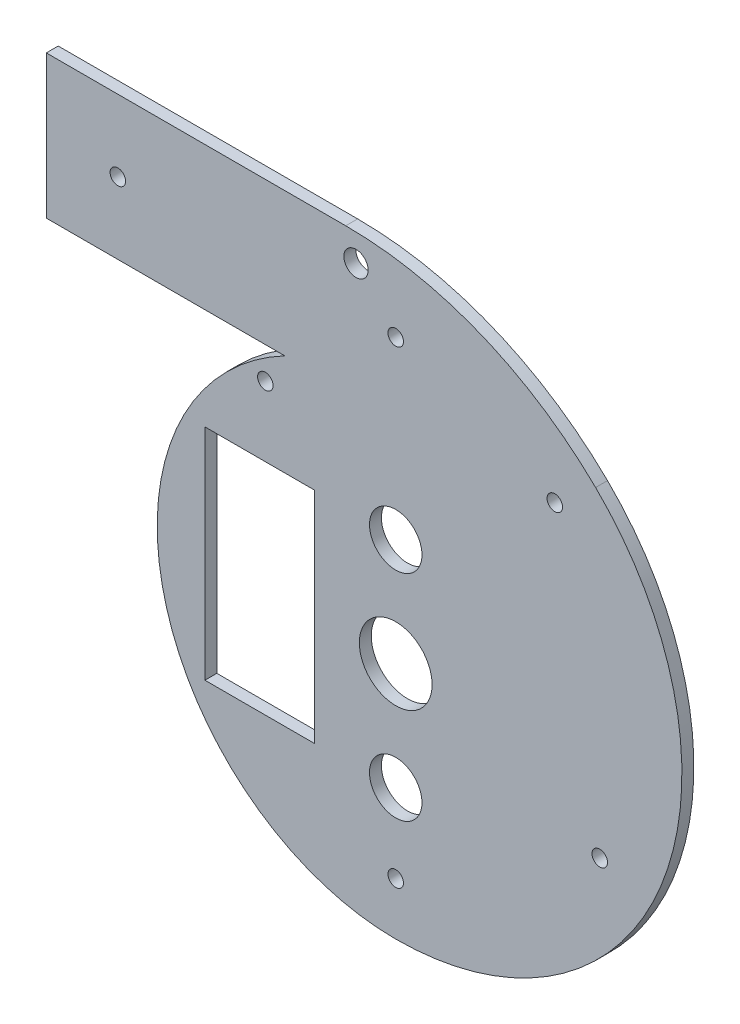
ISO-10303-21;
HEADER;
FILE_DESCRIPTION(('STEP AP214'),'2;1');
FILE_NAME('part.step','',(''),(''),'','','');
FILE_SCHEMA(('AUTOMOTIVE_DESIGN { 1 0 10303 214 1 1 1 1 }'));
ENDSEC;
DATA;
#1=APPLICATION_CONTEXT('core data for automotive mechanical design processes');
#2=APPLICATION_PROTOCOL_DEFINITION('international standard','automotive_design',2000,#1);
#3=PRODUCT_CONTEXT('',#1,'mechanical');
#4=PRODUCT('Part','Part','',(#3));
#5=PRODUCT_RELATED_PRODUCT_CATEGORY('part','',(#4));
#6=PRODUCT_DEFINITION_FORMATION('','',#4);
#7=PRODUCT_DEFINITION_CONTEXT('part definition',#1,'design');
#8=PRODUCT_DEFINITION('design','',#6,#7);
#9=PRODUCT_DEFINITION_SHAPE('','',#8);
#10=(LENGTH_UNIT() NAMED_UNIT(*) SI_UNIT(.MILLI.,.METRE.));
#11=(NAMED_UNIT(*) PLANE_ANGLE_UNIT() SI_UNIT($,.RADIAN.));
#12=(NAMED_UNIT(*) SI_UNIT($,.STERADIAN.) SOLID_ANGLE_UNIT());
#13=UNCERTAINTY_MEASURE_WITH_UNIT(LENGTH_MEASURE(1.E-05),#10,'distance_accuracy_value','');
#14=(GEOMETRIC_REPRESENTATION_CONTEXT(3) GLOBAL_UNCERTAINTY_ASSIGNED_CONTEXT((#13)) GLOBAL_UNIT_ASSIGNED_CONTEXT((#10,
#11,#12)) REPRESENTATION_CONTEXT('',''));
#15=CARTESIAN_POINT('',(0.,0.,0.));
#16=DIRECTION('',(0.,0.,1.));
#17=DIRECTION('',(1.,0.,0.));
#18=AXIS2_PLACEMENT_3D('',#15,#16,#17);
#19=CARTESIAN_POINT('',(-46.5031531468045,88.5294117647059,-5.));
#20=DIRECTION('',(0.,-1.,0.));
#21=DIRECTION('',(1.,0.,0.));
#22=AXIS2_PLACEMENT_3D('',#19,#20,#21);
#23=PLANE('',#22);
#24=DIRECTION('',(1.,0.,0.));
#25=VECTOR('',#24,1.);
#26=CARTESIAN_POINT('',(-46.5031531468045,88.5294117647059,0.));
#27=LINE('',#26,#25);
#28=CARTESIAN_POINT('',(-146.503153146805,88.5294117647059,0.));
#29=VERTEX_POINT('',#28);
#30=CARTESIAN_POINT('',(-46.5031531468045,88.5294117647059,0.));
#31=VERTEX_POINT('',#30);
#32=EDGE_CURVE('E213',#29,#31,#27,.T.);
#33=ORIENTED_EDGE('',*,*,#32,.F.);
#34=DIRECTION('',(0.,0.,1.));
#35=VECTOR('',#34,1.);
#36=CARTESIAN_POINT('',(-146.503153146805,88.5294117647059,-5.));
#37=LINE('',#36,#35);
#38=CARTESIAN_POINT('',(-146.503153146805,88.5294117647059,-5.));
#39=VERTEX_POINT('',#38);
#40=EDGE_CURVE('E45',#39,#29,#37,.T.);
#41=ORIENTED_EDGE('',*,*,#40,.F.);
#42=DIRECTION('',(1.,0.,0.));
#43=VECTOR('',#42,1.);
#44=CARTESIAN_POINT('',(-46.5031531468045,88.5294117647059,-5.));
#45=LINE('',#44,#43);
#46=CARTESIAN_POINT('',(-46.5031531468045,88.5294117647059,-5.));
#47=VERTEX_POINT('',#46);
#48=EDGE_CURVE('E225',#39,#47,#45,.T.);
#49=ORIENTED_EDGE('',*,*,#48,.T.);
#50=DIRECTION('',(0.,0.,1.));
#51=VECTOR('',#50,1.);
#52=CARTESIAN_POINT('',(-46.5031531468045,88.5294117647059,-5.));
#53=LINE('',#52,#51);
#54=EDGE_CURVE('E11',#47,#31,#53,.T.);
#55=ORIENTED_EDGE('',*,*,#54,.T.);
#56=EDGE_LOOP('',(#33,#41,#49,#55));
#57=FACE_BOUND('',#56,.T.);
#58=ADVANCED_FACE('F36',(#57),#23,.T.);
#59=CARTESIAN_POINT('',(-146.503153146805,148.529411764706,-5.));
#60=DIRECTION('',(-1.,0.,0.));
#61=DIRECTION('',(0.,0.,1.));
#62=AXIS2_PLACEMENT_3D('',#59,#60,#61);
#63=PLANE('',#62);
#64=DIRECTION('',(0.,-1.,0.));
#65=VECTOR('',#64,1.);
#66=CARTESIAN_POINT('',(-146.503153146805,148.529411764706,0.));
#67=LINE('',#66,#65);
#68=CARTESIAN_POINT('',(-146.503153146805,148.529411764706,0.));
#69=VERTEX_POINT('',#68);
#70=EDGE_CURVE('E239',#69,#29,#67,.T.);
#71=ORIENTED_EDGE('',*,*,#70,.F.);
#72=DIRECTION('',(0.,0.,1.));
#73=VECTOR('',#72,1.);
#74=CARTESIAN_POINT('',(-146.503153146805,148.529411764706,-5.));
#75=LINE('',#74,#73);
#76=CARTESIAN_POINT('',(-146.503153146805,148.529411764706,-5.));
#77=VERTEX_POINT('',#76);
#78=EDGE_CURVE('E245',#77,#69,#75,.T.);
#79=ORIENTED_EDGE('',*,*,#78,.F.);
#80=DIRECTION('',(0.,-1.,0.));
#81=VECTOR('',#80,1.);
#82=CARTESIAN_POINT('',(-146.503153146805,148.529411764706,-5.));
#83=LINE('',#82,#81);
#84=EDGE_CURVE('E222',#77,#39,#83,.T.);
#85=ORIENTED_EDGE('',*,*,#84,.T.);
#86=ORIENTED_EDGE('',*,*,#40,.T.);
#87=EDGE_LOOP('',(#71,#79,#85,#86));
#88=FACE_BOUND('',#87,.T.);
#89=ADVANCED_FACE('F273',(#88),#63,.T.);
#90=CARTESIAN_POINT('',(-20.9526571305515,148.529411764706,-5.));
#91=DIRECTION('',(0.,1.,0.));
#92=DIRECTION('',(0.,0.,1.));
#93=AXIS2_PLACEMENT_3D('',#90,#91,#92);
#94=PLANE('',#93);
#95=DIRECTION('',(-1.,0.,0.));
#96=VECTOR('',#95,1.);
#97=CARTESIAN_POINT('',(-20.9526571305515,148.529411764706,0.));
#98=LINE('',#97,#96);
#99=CARTESIAN_POINT('',(-20.9526571305515,148.529411764706,0.));
#100=VERTEX_POINT('',#99);
#101=EDGE_CURVE('E236',#100,#69,#98,.T.);
#102=ORIENTED_EDGE('',*,*,#101,.F.);
#103=DIRECTION('',(0.,0.,1.));
#104=VECTOR('',#103,1.);
#105=CARTESIAN_POINT('',(-20.9526571305515,148.529411764706,-5.));
#106=LINE('',#105,#104);
#107=CARTESIAN_POINT('',(-20.9526571305515,148.529411764706,-5.));
#108=VERTEX_POINT('',#107);
#109=EDGE_CURVE('E247',#108,#100,#106,.T.);
#110=ORIENTED_EDGE('',*,*,#109,.F.);
#111=DIRECTION('',(-1.,0.,0.));
#112=VECTOR('',#111,1.);
#113=CARTESIAN_POINT('',(-20.9526571305515,148.529411764706,-5.));
#114=LINE('',#113,#112);
#115=EDGE_CURVE('E219',#108,#77,#114,.T.);
#116=ORIENTED_EDGE('',*,*,#115,.T.);
#117=ORIENTED_EDGE('',*,*,#78,.T.);
#118=EDGE_LOOP('',(#102,#110,#116,#117));
#119=FACE_BOUND('',#118,.T.);
#120=ADVANCED_FACE('F271',(#119),#94,.T.);
#121=CARTESIAN_POINT('',(-20.9526571305515,-1.47058823529413,-5.));
#122=DIRECTION('',(0.,0.,1.));
#123=DIRECTION('',(1.,0.,0.));
#124=AXIS2_PLACEMENT_3D('',#121,#122,#123);
#125=CYLINDRICAL_SURFACE('',#124,150.);
#126=CARTESIAN_POINT('',(-20.9526571305515,-1.47058823529413,0.));
#127=DIRECTION('',(0.,0.,1.));
#128=DIRECTION('',(1.,0.,0.));
#129=AXIS2_PLACEMENT_3D('',#126,#127,#128);
#130=CIRCLE('',#129,150.);
#131=CARTESIAN_POINT('',(83.810628522206,105.882352941176,0.));
#132=VERTEX_POINT('',#131);
#133=EDGE_CURVE('E233',#132,#100,#130,.T.);
#134=ORIENTED_EDGE('',*,*,#133,.F.);
#135=DIRECTION('',(0.,0.,1.));
#136=VECTOR('',#135,1.);
#137=CARTESIAN_POINT('',(83.810628522206,105.882352941176,-5.));
#138=LINE('',#137,#136);
#139=CARTESIAN_POINT('',(83.810628522206,105.882352941176,-5.));
#140=VERTEX_POINT('',#139);
#141=EDGE_CURVE('E248',#140,#132,#138,.T.);
#142=ORIENTED_EDGE('',*,*,#141,.F.);
#143=CARTESIAN_POINT('',(-20.9526571305515,-1.47058823529413,-5.));
#144=DIRECTION('',(0.,0.,1.));
#145=DIRECTION('',(1.,0.,0.));
#146=AXIS2_PLACEMENT_3D('',#143,#144,#145);
#147=CIRCLE('',#146,150.);
#148=EDGE_CURVE('E216',#140,#108,#147,.T.);
#149=ORIENTED_EDGE('',*,*,#148,.T.);
#150=ORIENTED_EDGE('',*,*,#109,.T.);
#151=EDGE_LOOP('',(#134,#142,#149,#150));
#152=FACE_BOUND('',#151,.T.);
#153=ADVANCED_FACE('F268',(#152),#125,.T.);
#154=CARTESIAN_POINT('',(0.,20.,-5.));
#155=DIRECTION('',(0.,0.,1.));
#156=DIRECTION('',(1.,0.,0.));
#157=AXIS2_PLACEMENT_3D('',#154,#155,#156);
#158=CYLINDRICAL_SURFACE('',#157,120.);
#159=CARTESIAN_POINT('',(0.,20.,0.));
#160=DIRECTION('',(0.,0.,1.));
#161=DIRECTION('',(1.,0.,0.));
#162=AXIS2_PLACEMENT_3D('',#159,#160,#161);
#163=CIRCLE('',#162,120.);
#164=CARTESIAN_POINT('',(0.,-100.,0.));
#165=VERTEX_POINT('',#164);
#166=EDGE_CURVE('E230',#165,#132,#163,.T.);
#167=ORIENTED_EDGE('',*,*,#166,.F.);
#168=DIRECTION('',(0.,0.,1.));
#169=VECTOR('',#168,1.);
#170=CARTESIAN_POINT('',(0.,-100.,-5.));
#171=LINE('',#170,#169);
#172=CARTESIAN_POINT('',(0.,-100.,-5.));
#173=VERTEX_POINT('',#172);
#174=EDGE_CURVE('E40',#173,#165,#171,.T.);
#175=ORIENTED_EDGE('',*,*,#174,.F.);
#176=CARTESIAN_POINT('',(0.,20.,-5.));
#177=DIRECTION('',(0.,0.,1.));
#178=DIRECTION('',(1.,0.,0.));
#179=AXIS2_PLACEMENT_3D('',#176,#177,#178);
#180=CIRCLE('',#179,120.);
#181=EDGE_CURVE('E212',#173,#140,#180,.T.);
#182=ORIENTED_EDGE('',*,*,#181,.T.);
#183=ORIENTED_EDGE('',*,*,#141,.T.);
#184=EDGE_LOOP('',(#167,#175,#182,#183));
#185=FACE_BOUND('',#184,.T.);
#186=ADVANCED_FACE('F256',(#185),#158,.T.);
#187=CARTESIAN_POINT('',(0.,0.,-5.));
#188=DIRECTION('',(0.,0.,1.));
#189=DIRECTION('',(1.,0.,0.));
#190=AXIS2_PLACEMENT_3D('',#187,#188,#189);
#191=CYLINDRICAL_SURFACE('',#190,100.);
#192=CARTESIAN_POINT('',(0.,0.,0.));
#193=DIRECTION('',(0.,0.,1.));
#194=DIRECTION('',(1.,0.,0.));
#195=AXIS2_PLACEMENT_3D('',#192,#193,#194);
#196=CIRCLE('',#195,100.);
#197=EDGE_CURVE('E207',#31,#165,#196,.T.);
#198=ORIENTED_EDGE('',*,*,#197,.F.);
#199=ORIENTED_EDGE('',*,*,#54,.F.);
#200=CARTESIAN_POINT('',(0.,0.,-5.));
#201=DIRECTION('',(0.,0.,1.));
#202=DIRECTION('',(-1.,0.,0.));
#203=AXIS2_PLACEMENT_3D('',#200,#201,#202);
#204=CIRCLE('',#203,100.);
#205=EDGE_CURVE('E210',#47,#173,#204,.T.);
#206=ORIENTED_EDGE('',*,*,#205,.T.);
#207=ORIENTED_EDGE('',*,*,#174,.T.);
#208=EDGE_LOOP('',(#198,#199,#206,#207));
#209=FACE_BOUND('',#208,.T.);
#210=ADVANCED_FACE('F38',(#209),#191,.T.);
#211=CARTESIAN_POINT('',(0.,0.,-5.));
#212=DIRECTION('',(0.,0.,-1.));
#213=DIRECTION('',(-1.,0.,0.));
#214=AXIS2_PLACEMENT_3D('',#211,#212,#213);
#215=PLANE('',#214);
#216=DIRECTION('',(0.,-1.,0.));
#217=VECTOR('',#216,1.);
#218=CARTESIAN_POINT('',(-80.,46.,-5.));
#219=LINE('',#218,#217);
#220=CARTESIAN_POINT('',(-80.,46.,-5.));
#221=VERTEX_POINT('',#220);
#222=CARTESIAN_POINT('',(-80.,-46.,-5.));
#223=VERTEX_POINT('',#222);
#224=EDGE_CURVE('E125',#221,#223,#219,.T.);
#225=ORIENTED_EDGE('',*,*,#224,.T.);
#226=DIRECTION('',(1.,0.,0.));
#227=VECTOR('',#226,1.);
#228=CARTESIAN_POINT('',(-80.,-46.,-5.));
#229=LINE('',#228,#227);
#230=CARTESIAN_POINT('',(-34.,-46.,-5.));
#231=VERTEX_POINT('',#230);
#232=EDGE_CURVE('E114',#223,#231,#229,.T.);
#233=ORIENTED_EDGE('',*,*,#232,.T.);
#234=DIRECTION('',(0.,1.,0.));
#235=VECTOR('',#234,1.);
#236=CARTESIAN_POINT('',(-34.,46.,-5.));
#237=LINE('',#236,#235);
#238=CARTESIAN_POINT('',(-34.,46.,-5.));
#239=VERTEX_POINT('',#238);
#240=EDGE_CURVE('E136',#231,#239,#237,.T.);
#241=ORIENTED_EDGE('',*,*,#240,.T.);
#242=DIRECTION('',(-1.,0.,0.));
#243=VECTOR('',#242,1.);
#244=CARTESIAN_POINT('',(-80.,46.,-5.));
#245=LINE('',#244,#243);
#246=EDGE_CURVE('E132',#239,#221,#245,.T.);
#247=ORIENTED_EDGE('',*,*,#246,.T.);
#248=EDGE_LOOP('',(#225,#233,#241,#247));
#249=FACE_BOUND('',#248,.T.);
#250=CARTESIAN_POINT('',(-116.503153146805,118.529411764706,-5.));
#251=DIRECTION('',(0.,0.,-1.));
#252=DIRECTION('',(-1.,0.,0.));
#253=AXIS2_PLACEMENT_3D('',#250,#251,#252);
#254=CIRCLE('',#253,3.25000000000001);
#255=CARTESIAN_POINT('',(-119.753153146805,118.529411764706,-5.));
#256=VERTEX_POINT('',#255);
#257=EDGE_CURVE('E182',#256,#256,#254,.T.);
#258=ORIENTED_EDGE('',*,*,#257,.F.);
#259=EDGE_LOOP('',(#258));
#260=FACE_BOUND('',#259,.T.);
#261=CARTESIAN_POINT('',(0.,118.529411764706,-5.));
#262=DIRECTION('',(0.,0.,-1.));
#263=DIRECTION('',(-1.,0.,0.));
#264=AXIS2_PLACEMENT_3D('',#261,#262,#263);
#265=CIRCLE('',#264,3.25);
#266=CARTESIAN_POINT('',(-3.25000000000003,118.529411764706,-5.));
#267=VERTEX_POINT('',#266);
#268=EDGE_CURVE('E179',#267,#267,#265,.T.);
#269=ORIENTED_EDGE('',*,*,#268,.F.);
#270=EDGE_LOOP('',(#269));
#271=FACE_BOUND('',#270,.T.);
#272=CARTESIAN_POINT('',(66.7017060349526,91.8070222510918,-5.));
#273=DIRECTION('',(0.,0.,-1.));
#274=DIRECTION('',(-1.,0.,0.));
#275=AXIS2_PLACEMENT_3D('',#272,#273,#274);
#276=CIRCLE('',#275,3.25000000000001);
#277=CARTESIAN_POINT('',(63.4517060349526,91.8070222510918,-5.));
#278=VERTEX_POINT('',#277);
#279=EDGE_CURVE('E176',#278,#278,#276,.T.);
#280=ORIENTED_EDGE('',*,*,#279,.F.);
#281=EDGE_LOOP('',(#280));
#282=FACE_BOUND('',#281,.T.);
#283=CARTESIAN_POINT('',(85.5532437102211,-27.7979339580648,-5.));
#284=DIRECTION('',(0.,0.,-1.));
#285=DIRECTION('',(-1.,0.,0.));
#286=AXIS2_PLACEMENT_3D('',#283,#284,#285);
#287=CIRCLE('',#286,3.25000000000001);
#288=CARTESIAN_POINT('',(82.3032437102211,-27.7979339580648,-5.));
#289=VERTEX_POINT('',#288);
#290=EDGE_CURVE('E173',#289,#289,#287,.T.);
#291=ORIENTED_EDGE('',*,*,#290,.F.);
#292=EDGE_LOOP('',(#291));
#293=FACE_BOUND('',#292,.T.);
#294=CARTESIAN_POINT('',(-54.6640284632,75.2385804768701,-5.));
#295=DIRECTION('',(0.,0.,-1.));
#296=DIRECTION('',(-1.,0.,0.));
#297=AXIS2_PLACEMENT_3D('',#294,#295,#296);
#298=CIRCLE('',#297,3.25);
#299=CARTESIAN_POINT('',(-57.9140284632,75.2385804768701,-5.));
#300=VERTEX_POINT('',#299);
#301=EDGE_CURVE('E170',#300,#300,#298,.T.);
#302=ORIENTED_EDGE('',*,*,#301,.F.);
#303=EDGE_LOOP('',(#302));
#304=FACE_BOUND('',#303,.T.);
#305=CARTESIAN_POINT('',(0.,-78.,-5.));
#306=DIRECTION('',(0.,0.,-1.));
#307=DIRECTION('',(-1.,0.,0.));
#308=AXIS2_PLACEMENT_3D('',#305,#306,#307);
#309=CIRCLE('',#308,3.25);
#310=CARTESIAN_POINT('',(-3.25000000000002,-78.,-5.));
#311=VERTEX_POINT('',#310);
#312=EDGE_CURVE('E153',#311,#311,#309,.T.);
#313=ORIENTED_EDGE('',*,*,#312,.F.);
#314=EDGE_LOOP('',(#313));
#315=FACE_BOUND('',#314,.T.);
#316=CARTESIAN_POINT('',(0.,45.,-5.));
#317=DIRECTION('',(0.,0.,-1.));
#318=DIRECTION('',(-1.,0.,0.));
#319=AXIS2_PLACEMENT_3D('',#316,#317,#318);
#320=CIRCLE('',#319,11.);
#321=CARTESIAN_POINT('',(-11.,45.,-5.));
#322=VERTEX_POINT('',#321);
#323=EDGE_CURVE('E194',#322,#322,#320,.T.);
#324=ORIENTED_EDGE('',*,*,#323,.F.);
#325=EDGE_LOOP('',(#324));
#326=FACE_BOUND('',#325,.T.);
#327=CARTESIAN_POINT('',(0.,-45.,-5.));
#328=DIRECTION('',(0.,0.,-1.));
#329=DIRECTION('',(-1.,0.,0.));
#330=AXIS2_PLACEMENT_3D('',#327,#328,#329);
#331=CIRCLE('',#330,11.);
#332=CARTESIAN_POINT('',(-11.,-45.,-5.));
#333=VERTEX_POINT('',#332);
#334=EDGE_CURVE('E189',#333,#333,#331,.T.);
#335=ORIENTED_EDGE('',*,*,#334,.F.);
#336=EDGE_LOOP('',(#335));
#337=FACE_BOUND('',#336,.T.);
#338=CARTESIAN_POINT('',(0.,0.,-5.));
#339=DIRECTION('',(0.,0.,-1.));
#340=DIRECTION('',(-1.,0.,0.));
#341=AXIS2_PLACEMENT_3D('',#338,#339,#340);
#342=CIRCLE('',#341,15.25);
#343=CARTESIAN_POINT('',(-15.25,0.,-5.));
#344=VERTEX_POINT('',#343);
#345=EDGE_CURVE('E200',#344,#344,#342,.T.);
#346=ORIENTED_EDGE('',*,*,#345,.F.);
#347=EDGE_LOOP('',(#346));
#348=FACE_BOUND('',#347,.T.);
#349=CARTESIAN_POINT('',(-16.6526571305515,137.029411764706,-5.));
#350=DIRECTION('',(0.,0.,1.));
#351=DIRECTION('',(1.,0.,0.));
#352=AXIS2_PLACEMENT_3D('',#349,#350,#351);
#353=CIRCLE('',#352,5.1);
#354=CARTESIAN_POINT('',(-11.5526571305515,137.029411764706,-5.));
#355=VERTEX_POINT('',#354);
#356=EDGE_CURVE('E204',#355,#355,#353,.T.);
#357=ORIENTED_EDGE('',*,*,#356,.T.);
#358=EDGE_LOOP('',(#357));
#359=FACE_BOUND('',#358,.T.);
#360=ORIENTED_EDGE('',*,*,#205,.F.);
#361=ORIENTED_EDGE('',*,*,#48,.F.);
#362=ORIENTED_EDGE('',*,*,#84,.F.);
#363=ORIENTED_EDGE('',*,*,#115,.F.);
#364=ORIENTED_EDGE('',*,*,#148,.F.);
#365=ORIENTED_EDGE('',*,*,#181,.F.);
#366=EDGE_LOOP('',(#360,#361,#362,#363,#364,#365));
#367=FACE_BOUND('',#366,.T.);
#368=ADVANCED_FACE('F130',(#249,#260,#271,#282,#293,#304,#315,#326,#337,#348,#359,#367),#215,.T.);
#369=CARTESIAN_POINT('',(0.,0.,0.));
#370=DIRECTION('',(0.,0.,-1.));
#371=DIRECTION('',(-1.,0.,0.));
#372=AXIS2_PLACEMENT_3D('',#369,#370,#371);
#373=PLANE('',#372);
#374=DIRECTION('',(1.,0.,0.));
#375=VECTOR('',#374,1.);
#376=CARTESIAN_POINT('',(-80.,-46.,0.));
#377=LINE('',#376,#375);
#378=CARTESIAN_POINT('',(-80.,-46.,0.));
#379=VERTEX_POINT('',#378);
#380=CARTESIAN_POINT('',(-34.,-46.,0.));
#381=VERTEX_POINT('',#380);
#382=EDGE_CURVE('E134',#379,#381,#377,.T.);
#383=ORIENTED_EDGE('',*,*,#382,.F.);
#384=DIRECTION('',(0.,-1.,0.));
#385=VECTOR('',#384,1.);
#386=CARTESIAN_POINT('',(-80.,46.,0.));
#387=LINE('',#386,#385);
#388=CARTESIAN_POINT('',(-80.,46.,0.));
#389=VERTEX_POINT('',#388);
#390=EDGE_CURVE('E61',#389,#379,#387,.T.);
#391=ORIENTED_EDGE('',*,*,#390,.F.);
#392=DIRECTION('',(-1.,0.,0.));
#393=VECTOR('',#392,1.);
#394=CARTESIAN_POINT('',(-80.,46.,0.));
#395=LINE('',#394,#393);
#396=CARTESIAN_POINT('',(-34.,46.,0.));
#397=VERTEX_POINT('',#396);
#398=EDGE_CURVE('E127',#397,#389,#395,.T.);
#399=ORIENTED_EDGE('',*,*,#398,.F.);
#400=DIRECTION('',(0.,1.,0.));
#401=VECTOR('',#400,1.);
#402=CARTESIAN_POINT('',(-34.,46.,0.));
#403=LINE('',#402,#401);
#404=EDGE_CURVE('E141',#381,#397,#403,.T.);
#405=ORIENTED_EDGE('',*,*,#404,.F.);
#406=EDGE_LOOP('',(#383,#391,#399,#405));
#407=FACE_BOUND('',#406,.T.);
#408=CARTESIAN_POINT('',(-116.503153146805,118.529411764706,0.));
#409=DIRECTION('',(0.,0.,1.));
#410=DIRECTION('',(1.,0.,0.));
#411=AXIS2_PLACEMENT_3D('',#408,#409,#410);
#412=CIRCLE('',#411,3.25000000000001);
#413=CARTESIAN_POINT('',(-113.253153146805,118.529411764706,0.));
#414=VERTEX_POINT('',#413);
#415=EDGE_CURVE('E121',#414,#414,#412,.T.);
#416=ORIENTED_EDGE('',*,*,#415,.F.);
#417=EDGE_LOOP('',(#416));
#418=FACE_BOUND('',#417,.T.);
#419=CARTESIAN_POINT('',(0.,118.529411764706,0.));
#420=DIRECTION('',(0.,0.,1.));
#421=DIRECTION('',(1.,0.,0.));
#422=AXIS2_PLACEMENT_3D('',#419,#420,#421);
#423=CIRCLE('',#422,3.25);
#424=CARTESIAN_POINT('',(3.24999999999997,118.529411764706,0.));
#425=VERTEX_POINT('',#424);
#426=EDGE_CURVE('E163',#425,#425,#423,.T.);
#427=ORIENTED_EDGE('',*,*,#426,.F.);
#428=EDGE_LOOP('',(#427));
#429=FACE_BOUND('',#428,.T.);
#430=CARTESIAN_POINT('',(66.7017060349526,91.8070222510918,0.));
#431=DIRECTION('',(0.,0.,1.));
#432=DIRECTION('',(1.,0.,0.));
#433=AXIS2_PLACEMENT_3D('',#430,#431,#432);
#434=CIRCLE('',#433,3.25000000000001);
#435=CARTESIAN_POINT('',(69.9517060349526,91.8070222510918,0.));
#436=VERTEX_POINT('',#435);
#437=EDGE_CURVE('E160',#436,#436,#434,.T.);
#438=ORIENTED_EDGE('',*,*,#437,.F.);
#439=EDGE_LOOP('',(#438));
#440=FACE_BOUND('',#439,.T.);
#441=CARTESIAN_POINT('',(85.5532437102211,-27.7979339580648,0.));
#442=DIRECTION('',(0.,0.,1.));
#443=DIRECTION('',(1.,0.,0.));
#444=AXIS2_PLACEMENT_3D('',#441,#442,#443);
#445=CIRCLE('',#444,3.25000000000001);
#446=CARTESIAN_POINT('',(88.8032437102211,-27.7979339580648,0.));
#447=VERTEX_POINT('',#446);
#448=EDGE_CURVE('E157',#447,#447,#445,.T.);
#449=ORIENTED_EDGE('',*,*,#448,.F.);
#450=EDGE_LOOP('',(#449));
#451=FACE_BOUND('',#450,.T.);
#452=CARTESIAN_POINT('',(-54.6640284632,75.2385804768701,0.));
#453=DIRECTION('',(0.,0.,1.));
#454=DIRECTION('',(1.,0.,0.));
#455=AXIS2_PLACEMENT_3D('',#452,#453,#454);
#456=CIRCLE('',#455,3.25);
#457=CARTESIAN_POINT('',(-51.4140284632,75.2385804768701,0.));
#458=VERTEX_POINT('',#457);
#459=EDGE_CURVE('E154',#458,#458,#456,.T.);
#460=ORIENTED_EDGE('',*,*,#459,.F.);
#461=EDGE_LOOP('',(#460));
#462=FACE_BOUND('',#461,.T.);
#463=CARTESIAN_POINT('',(0.,-78.,0.));
#464=DIRECTION('',(0.,0.,1.));
#465=DIRECTION('',(1.,0.,0.));
#466=AXIS2_PLACEMENT_3D('',#463,#464,#465);
#467=CIRCLE('',#466,3.25);
#468=CARTESIAN_POINT('',(3.24999999999998,-78.,0.));
#469=VERTEX_POINT('',#468);
#470=EDGE_CURVE('E150',#469,#469,#467,.T.);
#471=ORIENTED_EDGE('',*,*,#470,.F.);
#472=EDGE_LOOP('',(#471));
#473=FACE_BOUND('',#472,.T.);
#474=CARTESIAN_POINT('',(0.,45.,0.));
#475=DIRECTION('',(0.,0.,1.));
#476=DIRECTION('',(1.,0.,0.));
#477=AXIS2_PLACEMENT_3D('',#474,#475,#476);
#478=CIRCLE('',#477,11.);
#479=CARTESIAN_POINT('',(11.,45.,0.));
#480=VERTEX_POINT('',#479);
#481=EDGE_CURVE('E186',#480,#480,#478,.T.);
#482=ORIENTED_EDGE('',*,*,#481,.F.);
#483=EDGE_LOOP('',(#482));
#484=FACE_BOUND('',#483,.T.);
#485=CARTESIAN_POINT('',(0.,-45.,0.));
#486=DIRECTION('',(0.,0.,1.));
#487=DIRECTION('',(1.,0.,0.));
#488=AXIS2_PLACEMENT_3D('',#485,#486,#487);
#489=CIRCLE('',#488,11.);
#490=CARTESIAN_POINT('',(11.,-45.,0.));
#491=VERTEX_POINT('',#490);
#492=EDGE_CURVE('E185',#491,#491,#489,.T.);
#493=ORIENTED_EDGE('',*,*,#492,.F.);
#494=EDGE_LOOP('',(#493));
#495=FACE_BOUND('',#494,.T.);
#496=CARTESIAN_POINT('',(0.,0.,0.));
#497=DIRECTION('',(0.,0.,1.));
#498=DIRECTION('',(1.,0.,0.));
#499=AXIS2_PLACEMENT_3D('',#496,#497,#498);
#500=CIRCLE('',#499,15.25);
#501=CARTESIAN_POINT('',(15.25,0.,0.));
#502=VERTEX_POINT('',#501);
#503=EDGE_CURVE('E197',#502,#502,#500,.T.);
#504=ORIENTED_EDGE('',*,*,#503,.F.);
#505=EDGE_LOOP('',(#504));
#506=FACE_BOUND('',#505,.T.);
#507=CARTESIAN_POINT('',(-16.6526571305515,137.029411764706,0.));
#508=DIRECTION('',(0.,0.,1.));
#509=DIRECTION('',(1.,0.,0.));
#510=AXIS2_PLACEMENT_3D('',#507,#508,#509);
#511=CIRCLE('',#510,5.1);
#512=CARTESIAN_POINT('',(-11.5526571305515,137.029411764706,0.));
#513=VERTEX_POINT('',#512);
#514=EDGE_CURVE('E203',#513,#513,#511,.T.);
#515=ORIENTED_EDGE('',*,*,#514,.F.);
#516=EDGE_LOOP('',(#515));
#517=FACE_BOUND('',#516,.T.);
#518=ORIENTED_EDGE('',*,*,#32,.T.);
#519=ORIENTED_EDGE('',*,*,#197,.T.);
#520=ORIENTED_EDGE('',*,*,#166,.T.);
#521=ORIENTED_EDGE('',*,*,#133,.T.);
#522=ORIENTED_EDGE('',*,*,#101,.T.);
#523=ORIENTED_EDGE('',*,*,#70,.T.);
#524=EDGE_LOOP('',(#518,#519,#520,#521,#522,#523));
#525=FACE_BOUND('',#524,.T.);
#526=ADVANCED_FACE('F258',(#407,#418,#429,#440,#451,#462,#473,#484,#495,#506,#517,#525),#373,.F.);
#527=CARTESIAN_POINT('',(-16.6526571305515,137.029411764706,-5.));
#528=DIRECTION('',(0.,0.,1.));
#529=DIRECTION('',(1.,0.,0.));
#530=AXIS2_PLACEMENT_3D('',#527,#528,#529);
#531=CYLINDRICAL_SURFACE('',#530,5.1);
#532=ORIENTED_EDGE('',*,*,#356,.F.);
#533=EDGE_LOOP('',(#532));
#534=FACE_BOUND('',#533,.T.);
#535=ORIENTED_EDGE('',*,*,#514,.T.);
#536=EDGE_LOOP('',(#535));
#537=FACE_BOUND('',#536,.T.);
#538=ADVANCED_FACE('F296',(#534,#537),#531,.F.);
#539=CARTESIAN_POINT('',(0.,0.,-10.));
#540=DIRECTION('',(0.,0.,1.));
#541=DIRECTION('',(1.,0.,0.));
#542=AXIS2_PLACEMENT_3D('',#539,#540,#541);
#543=CYLINDRICAL_SURFACE('',#542,15.25);
#544=ORIENTED_EDGE('',*,*,#345,.T.);
#545=EDGE_LOOP('',(#544));
#546=FACE_BOUND('',#545,.T.);
#547=ORIENTED_EDGE('',*,*,#503,.T.);
#548=EDGE_LOOP('',(#547));
#549=FACE_BOUND('',#548,.T.);
#550=ADVANCED_FACE('F301',(#546,#549),#543,.F.);
#551=CARTESIAN_POINT('',(0.,-45.,-10.));
#552=DIRECTION('',(0.,0.,1.));
#553=DIRECTION('',(1.,0.,0.));
#554=AXIS2_PLACEMENT_3D('',#551,#552,#553);
#555=CYLINDRICAL_SURFACE('',#554,11.);
#556=ORIENTED_EDGE('',*,*,#334,.T.);
#557=EDGE_LOOP('',(#556));
#558=FACE_BOUND('',#557,.T.);
#559=ORIENTED_EDGE('',*,*,#492,.T.);
#560=EDGE_LOOP('',(#559));
#561=FACE_BOUND('',#560,.T.);
#562=ADVANCED_FACE('F305',(#558,#561),#555,.F.);
#563=CARTESIAN_POINT('',(0.,45.,-10.));
#564=DIRECTION('',(0.,0.,1.));
#565=DIRECTION('',(1.,0.,0.));
#566=AXIS2_PLACEMENT_3D('',#563,#564,#565);
#567=CYLINDRICAL_SURFACE('',#566,11.);
#568=ORIENTED_EDGE('',*,*,#323,.T.);
#569=EDGE_LOOP('',(#568));
#570=FACE_BOUND('',#569,.T.);
#571=ORIENTED_EDGE('',*,*,#481,.T.);
#572=EDGE_LOOP('',(#571));
#573=FACE_BOUND('',#572,.T.);
#574=ADVANCED_FACE('F309',(#570,#573),#567,.F.);
#575=CARTESIAN_POINT('',(0.,-78.,-10.));
#576=DIRECTION('',(0.,0.,1.));
#577=DIRECTION('',(1.,0.,0.));
#578=AXIS2_PLACEMENT_3D('',#575,#576,#577);
#579=CYLINDRICAL_SURFACE('',#578,3.25);
#580=ORIENTED_EDGE('',*,*,#312,.T.);
#581=EDGE_LOOP('',(#580));
#582=FACE_BOUND('',#581,.T.);
#583=ORIENTED_EDGE('',*,*,#470,.T.);
#584=EDGE_LOOP('',(#583));
#585=FACE_BOUND('',#584,.T.);
#586=ADVANCED_FACE('F313',(#582,#585),#579,.F.);
#587=CARTESIAN_POINT('',(-54.6640284632,75.2385804768701,-10.));
#588=DIRECTION('',(0.,0.,1.));
#589=DIRECTION('',(1.,0.,0.));
#590=AXIS2_PLACEMENT_3D('',#587,#588,#589);
#591=CYLINDRICAL_SURFACE('',#590,3.25);
#592=ORIENTED_EDGE('',*,*,#301,.T.);
#593=EDGE_LOOP('',(#592));
#594=FACE_BOUND('',#593,.T.);
#595=ORIENTED_EDGE('',*,*,#459,.T.);
#596=EDGE_LOOP('',(#595));
#597=FACE_BOUND('',#596,.T.);
#598=ADVANCED_FACE('F330',(#594,#597),#591,.F.);
#599=CARTESIAN_POINT('',(85.5532437102211,-27.7979339580648,-10.));
#600=DIRECTION('',(0.,0.,1.));
#601=DIRECTION('',(1.,0.,0.));
#602=AXIS2_PLACEMENT_3D('',#599,#600,#601);
#603=CYLINDRICAL_SURFACE('',#602,3.25000000000001);
#604=ORIENTED_EDGE('',*,*,#290,.T.);
#605=EDGE_LOOP('',(#604));
#606=FACE_BOUND('',#605,.T.);
#607=ORIENTED_EDGE('',*,*,#448,.T.);
#608=EDGE_LOOP('',(#607));
#609=FACE_BOUND('',#608,.T.);
#610=ADVANCED_FACE('F326',(#606,#609),#603,.F.);
#611=CARTESIAN_POINT('',(66.7017060349526,91.8070222510918,-10.));
#612=DIRECTION('',(0.,0.,1.));
#613=DIRECTION('',(1.,0.,0.));
#614=AXIS2_PLACEMENT_3D('',#611,#612,#613);
#615=CYLINDRICAL_SURFACE('',#614,3.25000000000001);
#616=ORIENTED_EDGE('',*,*,#279,.T.);
#617=EDGE_LOOP('',(#616));
#618=FACE_BOUND('',#617,.T.);
#619=ORIENTED_EDGE('',*,*,#437,.T.);
#620=EDGE_LOOP('',(#619));
#621=FACE_BOUND('',#620,.T.);
#622=ADVANCED_FACE('F322',(#618,#621),#615,.F.);
#623=CARTESIAN_POINT('',(0.,118.529411764706,-10.));
#624=DIRECTION('',(0.,0.,1.));
#625=DIRECTION('',(1.,0.,0.));
#626=AXIS2_PLACEMENT_3D('',#623,#624,#625);
#627=CYLINDRICAL_SURFACE('',#626,3.25);
#628=ORIENTED_EDGE('',*,*,#268,.T.);
#629=EDGE_LOOP('',(#628));
#630=FACE_BOUND('',#629,.T.);
#631=ORIENTED_EDGE('',*,*,#426,.T.);
#632=EDGE_LOOP('',(#631));
#633=FACE_BOUND('',#632,.T.);
#634=ADVANCED_FACE('F318',(#630,#633),#627,.F.);
#635=CARTESIAN_POINT('',(-116.503153146805,118.529411764706,-10.));
#636=DIRECTION('',(0.,0.,1.));
#637=DIRECTION('',(1.,0.,0.));
#638=AXIS2_PLACEMENT_3D('',#635,#636,#637);
#639=CYLINDRICAL_SURFACE('',#638,3.25000000000001);
#640=ORIENTED_EDGE('',*,*,#257,.T.);
#641=EDGE_LOOP('',(#640));
#642=FACE_BOUND('',#641,.T.);
#643=ORIENTED_EDGE('',*,*,#415,.T.);
#644=EDGE_LOOP('',(#643));
#645=FACE_BOUND('',#644,.T.);
#646=ADVANCED_FACE('F315',(#642,#645),#639,.F.);
#647=CARTESIAN_POINT('',(-80.,46.,-5.001));
#648=DIRECTION('',(-1.,0.,0.));
#649=DIRECTION('',(0.,0.,1.));
#650=AXIS2_PLACEMENT_3D('',#647,#648,#649);
#651=PLANE('',#650);
#652=DIRECTION('',(0.,0.,1.));
#653=VECTOR('',#652,1.);
#654=CARTESIAN_POINT('',(-80.,46.,-5.001));
#655=LINE('',#654,#653);
#656=EDGE_CURVE('E122',#221,#389,#655,.T.);
#657=ORIENTED_EDGE('',*,*,#656,.T.);
#658=ORIENTED_EDGE('',*,*,#390,.T.);
#659=DIRECTION('',(0.,0.,1.));
#660=VECTOR('',#659,1.);
#661=CARTESIAN_POINT('',(-80.,-46.,-5.001));
#662=LINE('',#661,#660);
#663=EDGE_CURVE('E116',#223,#379,#662,.T.);
#664=ORIENTED_EDGE('',*,*,#663,.F.);
#665=ORIENTED_EDGE('',*,*,#224,.F.);
#666=EDGE_LOOP('',(#657,#658,#664,#665));
#667=FACE_BOUND('',#666,.T.);
#668=ADVANCED_FACE('F124',(#667),#651,.F.);
#669=CARTESIAN_POINT('',(-80.,46.,-5.001));
#670=DIRECTION('',(0.,1.,0.));
#671=DIRECTION('',(-1.,0.,0.));
#672=AXIS2_PLACEMENT_3D('',#669,#670,#671);
#673=PLANE('',#672);
#674=DIRECTION('',(0.,0.,1.));
#675=VECTOR('',#674,1.);
#676=CARTESIAN_POINT('',(-34.,46.,-5.001));
#677=LINE('',#676,#675);
#678=EDGE_CURVE('E147',#239,#397,#677,.T.);
#679=ORIENTED_EDGE('',*,*,#678,.T.);
#680=ORIENTED_EDGE('',*,*,#398,.T.);
#681=ORIENTED_EDGE('',*,*,#656,.F.);
#682=ORIENTED_EDGE('',*,*,#246,.F.);
#683=EDGE_LOOP('',(#679,#680,#681,#682));
#684=FACE_BOUND('',#683,.T.);
#685=ADVANCED_FACE('F340',(#684),#673,.F.);
#686=CARTESIAN_POINT('',(-34.,46.,-5.001));
#687=DIRECTION('',(1.,0.,0.));
#688=DIRECTION('',(0.,0.,-1.));
#689=AXIS2_PLACEMENT_3D('',#686,#687,#688);
#690=PLANE('',#689);
#691=DIRECTION('',(0.,0.,1.));
#692=VECTOR('',#691,1.);
#693=CARTESIAN_POINT('',(-34.,-46.,-5.001));
#694=LINE('',#693,#692);
#695=EDGE_CURVE('E53',#231,#381,#694,.T.);
#696=ORIENTED_EDGE('',*,*,#695,.T.);
#697=ORIENTED_EDGE('',*,*,#404,.T.);
#698=ORIENTED_EDGE('',*,*,#678,.F.);
#699=ORIENTED_EDGE('',*,*,#240,.F.);
#700=EDGE_LOOP('',(#696,#697,#698,#699));
#701=FACE_BOUND('',#700,.T.);
#702=ADVANCED_FACE('F343',(#701),#690,.F.);
#703=CARTESIAN_POINT('',(-80.,-46.,-5.001));
#704=DIRECTION('',(0.,-1.,0.));
#705=DIRECTION('',(0.,0.,-1.));
#706=AXIS2_PLACEMENT_3D('',#703,#704,#705);
#707=PLANE('',#706);
#708=ORIENTED_EDGE('',*,*,#663,.T.);
#709=ORIENTED_EDGE('',*,*,#382,.T.);
#710=ORIENTED_EDGE('',*,*,#695,.F.);
#711=ORIENTED_EDGE('',*,*,#232,.F.);
#712=EDGE_LOOP('',(#708,#709,#710,#711));
#713=FACE_BOUND('',#712,.T.);
#714=ADVANCED_FACE('F115',(#713),#707,.F.);
#715=CLOSED_SHELL('',(#58,#89,#120,#153,#186,#210,#368,#526,#538,#550,#562,#574,#586,#598,#610,
#622,#634,#646,#668,#685,#702,#714));
#716=MANIFOLD_SOLID_BREP('B2',#715);
#717=ADVANCED_BREP_SHAPE_REPRESENTATION('',(#18,#716),#14);
#718=SHAPE_DEFINITION_REPRESENTATION(#9,#717);
ENDSEC;
END-ISO-10303-21;
